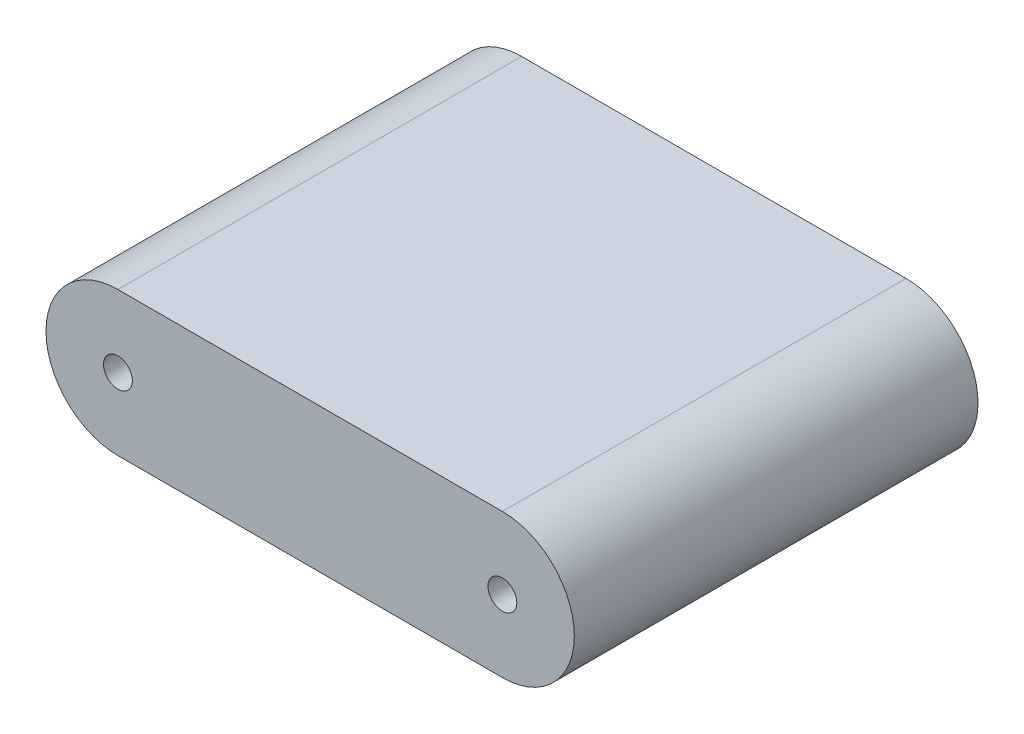
ISO-10303-21;
HEADER;
FILE_DESCRIPTION(('STEP AP214'),'2;1');
FILE_NAME('part.step','',(''),(''),'','','');
FILE_SCHEMA(('AUTOMOTIVE_DESIGN { 1 0 10303 214 1 1 1 1 }'));
ENDSEC;
DATA;
#1=APPLICATION_CONTEXT('core data for automotive mechanical design processes');
#2=APPLICATION_PROTOCOL_DEFINITION('international standard','automotive_design',2000,#1);
#3=PRODUCT_CONTEXT('',#1,'mechanical');
#4=PRODUCT('Part','Part','',(#3));
#5=PRODUCT_RELATED_PRODUCT_CATEGORY('part','',(#4));
#6=PRODUCT_DEFINITION_FORMATION('','',#4);
#7=PRODUCT_DEFINITION_CONTEXT('part definition',#1,'design');
#8=PRODUCT_DEFINITION('design','',#6,#7);
#9=PRODUCT_DEFINITION_SHAPE('','',#8);
#10=(LENGTH_UNIT() NAMED_UNIT(*) SI_UNIT(.MILLI.,.METRE.));
#11=(NAMED_UNIT(*) PLANE_ANGLE_UNIT() SI_UNIT($,.RADIAN.));
#12=(NAMED_UNIT(*) SI_UNIT($,.STERADIAN.) SOLID_ANGLE_UNIT());
#13=UNCERTAINTY_MEASURE_WITH_UNIT(LENGTH_MEASURE(1.E-05),#10,'distance_accuracy_value','');
#14=(GEOMETRIC_REPRESENTATION_CONTEXT(3) GLOBAL_UNCERTAINTY_ASSIGNED_CONTEXT((#13)) GLOBAL_UNIT_ASSIGNED_CONTEXT((#10,
#11,#12)) REPRESENTATION_CONTEXT('',''));
#15=CARTESIAN_POINT('',(0.,0.,0.));
#16=DIRECTION('',(0.,0.,1.));
#17=DIRECTION('',(1.,0.,0.));
#18=AXIS2_PLACEMENT_3D('',#15,#16,#17);
#19=CARTESIAN_POINT('',(-20.,0.,42.));
#20=DIRECTION('',(0.,0.,1.));
#21=DIRECTION('',(1.,0.,0.));
#22=AXIS2_PLACEMENT_3D('',#19,#20,#21);
#23=PLANE('',#22);
#24=CARTESIAN_POINT('',(20.,0.,42.));
#25=DIRECTION('',(0.,0.,1.));
#26=DIRECTION('',(1.,0.,0.));
#27=AXIS2_PLACEMENT_3D('',#24,#25,#26);
#28=CIRCLE('',#27,1.5);
#29=CARTESIAN_POINT('',(21.5,0.,42.));
#30=VERTEX_POINT('',#29);
#31=EDGE_CURVE('E105',#30,#30,#28,.T.);
#32=ORIENTED_EDGE('',*,*,#31,.F.);
#33=EDGE_LOOP('',(#32));
#34=FACE_BOUND('',#33,.T.);
#35=CARTESIAN_POINT('',(-20.,0.,42.));
#36=DIRECTION('',(0.,0.,1.));
#37=DIRECTION('',(1.,0.,0.));
#38=AXIS2_PLACEMENT_3D('',#35,#36,#37);
#39=CIRCLE('',#38,7.4832739323454);
#40=CARTESIAN_POINT('',(-20.,7.4832739323454,42.));
#41=VERTEX_POINT('',#40);
#42=CARTESIAN_POINT('',(-20.,-7.4832739323454,42.));
#43=VERTEX_POINT('',#42);
#44=EDGE_CURVE('E90',#41,#43,#39,.T.);
#45=ORIENTED_EDGE('',*,*,#44,.T.);
#46=DIRECTION('',(1.,0.,0.));
#47=VECTOR('',#46,1.);
#48=CARTESIAN_POINT('',(-20.,-7.4832739323454,42.));
#49=LINE('',#48,#47);
#50=CARTESIAN_POINT('',(20.,-7.4832739323454,42.));
#51=VERTEX_POINT('',#50);
#52=EDGE_CURVE('E85',#43,#51,#49,.T.);
#53=ORIENTED_EDGE('',*,*,#52,.T.);
#54=CARTESIAN_POINT('',(20.,0.,42.));
#55=DIRECTION('',(0.,0.,1.));
#56=DIRECTION('',(1.,0.,0.));
#57=AXIS2_PLACEMENT_3D('',#54,#55,#56);
#58=CIRCLE('',#57,7.4832739323454);
#59=CARTESIAN_POINT('',(20.,7.4832739323454,42.));
#60=VERTEX_POINT('',#59);
#61=EDGE_CURVE('E88',#51,#60,#58,.T.);
#62=ORIENTED_EDGE('',*,*,#61,.T.);
#63=DIRECTION('',(-1.,0.,0.));
#64=VECTOR('',#63,1.);
#65=CARTESIAN_POINT('',(-20.,7.4832739323454,42.));
#66=LINE('',#65,#64);
#67=EDGE_CURVE('E55',#60,#41,#66,.T.);
#68=ORIENTED_EDGE('',*,*,#67,.T.);
#69=EDGE_LOOP('',(#45,#53,#62,#68));
#70=FACE_BOUND('',#69,.T.);
#71=CARTESIAN_POINT('',(-20.,0.,42.));
#72=DIRECTION('',(0.,0.,1.));
#73=DIRECTION('',(1.,0.,0.));
#74=AXIS2_PLACEMENT_3D('',#71,#72,#73);
#75=CIRCLE('',#74,1.5);
#76=CARTESIAN_POINT('',(-18.5,0.,42.));
#77=VERTEX_POINT('',#76);
#78=EDGE_CURVE('E120',#77,#77,#75,.T.);
#79=ORIENTED_EDGE('',*,*,#78,.F.);
#80=EDGE_LOOP('',(#79));
#81=FACE_BOUND('',#80,.T.);
#82=ADVANCED_FACE('F38',(#34,#70,#81),#23,.T.);
#83=CARTESIAN_POINT('',(-20.,0.,0.));
#84=DIRECTION('',(0.,0.,1.));
#85=DIRECTION('',(1.,0.,0.));
#86=AXIS2_PLACEMENT_3D('',#83,#84,#85);
#87=PLANE('',#86);
#88=CARTESIAN_POINT('',(-20.,0.,0.));
#89=DIRECTION('',(0.,0.,1.));
#90=DIRECTION('',(1.,0.,0.));
#91=AXIS2_PLACEMENT_3D('',#88,#89,#90);
#92=CIRCLE('',#91,7.4832739323454);
#93=CARTESIAN_POINT('',(-20.,7.4832739323454,0.));
#94=VERTEX_POINT('',#93);
#95=CARTESIAN_POINT('',(-20.,-7.4832739323454,0.));
#96=VERTEX_POINT('',#95);
#97=EDGE_CURVE('E102',#94,#96,#92,.T.);
#98=ORIENTED_EDGE('',*,*,#97,.F.);
#99=DIRECTION('',(-1.,0.,0.));
#100=VECTOR('',#99,1.);
#101=CARTESIAN_POINT('',(-20.,7.4832739323454,0.));
#102=LINE('',#101,#100);
#103=CARTESIAN_POINT('',(20.,7.4832739323454,0.));
#104=VERTEX_POINT('',#103);
#105=EDGE_CURVE('E78',#104,#94,#102,.T.);
#106=ORIENTED_EDGE('',*,*,#105,.F.);
#107=CARTESIAN_POINT('',(20.,0.,0.));
#108=DIRECTION('',(0.,0.,1.));
#109=DIRECTION('',(1.,0.,0.));
#110=AXIS2_PLACEMENT_3D('',#107,#108,#109);
#111=CIRCLE('',#110,7.4832739323454);
#112=CARTESIAN_POINT('',(20.,-7.4832739323454,0.));
#113=VERTEX_POINT('',#112);
#114=EDGE_CURVE('E72',#113,#104,#111,.T.);
#115=ORIENTED_EDGE('',*,*,#114,.F.);
#116=DIRECTION('',(1.,0.,0.));
#117=VECTOR('',#116,1.);
#118=CARTESIAN_POINT('',(-20.,-7.4832739323454,0.));
#119=LINE('',#118,#117);
#120=EDGE_CURVE('E94',#96,#113,#119,.T.);
#121=ORIENTED_EDGE('',*,*,#120,.F.);
#122=EDGE_LOOP('',(#98,#106,#115,#121));
#123=FACE_BOUND('',#122,.T.);
#124=CARTESIAN_POINT('',(20.,0.,0.));
#125=DIRECTION('',(0.,0.,1.));
#126=DIRECTION('',(1.,0.,0.));
#127=AXIS2_PLACEMENT_3D('',#124,#125,#126);
#128=CIRCLE('',#127,1.5);
#129=CARTESIAN_POINT('',(21.5,0.,0.));
#130=VERTEX_POINT('',#129);
#131=EDGE_CURVE('E117',#130,#130,#128,.T.);
#132=ORIENTED_EDGE('',*,*,#131,.T.);
#133=EDGE_LOOP('',(#132));
#134=FACE_BOUND('',#133,.T.);
#135=CARTESIAN_POINT('',(-20.,0.,0.));
#136=DIRECTION('',(0.,0.,1.));
#137=DIRECTION('',(1.,0.,0.));
#138=AXIS2_PLACEMENT_3D('',#135,#136,#137);
#139=CIRCLE('',#138,1.5);
#140=CARTESIAN_POINT('',(-18.5,0.,0.));
#141=VERTEX_POINT('',#140);
#142=EDGE_CURVE('E123',#141,#141,#139,.T.);
#143=ORIENTED_EDGE('',*,*,#142,.T.);
#144=EDGE_LOOP('',(#143));
#145=FACE_BOUND('',#144,.T.);
#146=ADVANCED_FACE('F113',(#123,#134,#145),#87,.F.);
#147=CARTESIAN_POINT('',(-20.,0.,42.));
#148=DIRECTION('',(0.,0.,-1.));
#149=DIRECTION('',(-1.,0.,0.));
#150=AXIS2_PLACEMENT_3D('',#147,#148,#149);
#151=CYLINDRICAL_SURFACE('',#150,7.4832739323454);
#152=ORIENTED_EDGE('',*,*,#97,.T.);
#153=DIRECTION('',(0.,0.,-1.));
#154=VECTOR('',#153,1.);
#155=CARTESIAN_POINT('',(-20.,-7.4832739323454,42.));
#156=LINE('',#155,#154);
#157=EDGE_CURVE('E11',#43,#96,#156,.T.);
#158=ORIENTED_EDGE('',*,*,#157,.F.);
#159=ORIENTED_EDGE('',*,*,#44,.F.);
#160=DIRECTION('',(0.,0.,-1.));
#161=VECTOR('',#160,1.);
#162=CARTESIAN_POINT('',(-20.,7.4832739323454,42.));
#163=LINE('',#162,#161);
#164=EDGE_CURVE('E98',#41,#94,#163,.T.);
#165=ORIENTED_EDGE('',*,*,#164,.T.);
#166=EDGE_LOOP('',(#152,#158,#159,#165));
#167=FACE_BOUND('',#166,.T.);
#168=ADVANCED_FACE('F40',(#167),#151,.T.);
#169=CARTESIAN_POINT('',(-20.,-7.4832739323454,42.));
#170=DIRECTION('',(0.,1.,0.));
#171=DIRECTION('',(0.,0.,1.));
#172=AXIS2_PLACEMENT_3D('',#169,#170,#171);
#173=PLANE('',#172);
#174=ORIENTED_EDGE('',*,*,#120,.T.);
#175=DIRECTION('',(0.,0.,-1.));
#176=VECTOR('',#175,1.);
#177=CARTESIAN_POINT('',(20.,-7.4832739323454,42.));
#178=LINE('',#177,#176);
#179=EDGE_CURVE('E47',#51,#113,#178,.T.);
#180=ORIENTED_EDGE('',*,*,#179,.F.);
#181=ORIENTED_EDGE('',*,*,#52,.F.);
#182=ORIENTED_EDGE('',*,*,#157,.T.);
#183=EDGE_LOOP('',(#174,#180,#181,#182));
#184=FACE_BOUND('',#183,.T.);
#185=ADVANCED_FACE('F93',(#184),#173,.F.);
#186=CARTESIAN_POINT('',(20.,0.,42.));
#187=DIRECTION('',(0.,0.,-1.));
#188=DIRECTION('',(-1.,0.,0.));
#189=AXIS2_PLACEMENT_3D('',#186,#187,#188);
#190=CYLINDRICAL_SURFACE('',#189,7.4832739323454);
#191=ORIENTED_EDGE('',*,*,#114,.T.);
#192=DIRECTION('',(0.,0.,-1.));
#193=VECTOR('',#192,1.);
#194=CARTESIAN_POINT('',(20.,7.4832739323454,42.));
#195=LINE('',#194,#193);
#196=EDGE_CURVE('E95',#60,#104,#195,.T.);
#197=ORIENTED_EDGE('',*,*,#196,.F.);
#198=ORIENTED_EDGE('',*,*,#61,.F.);
#199=ORIENTED_EDGE('',*,*,#179,.T.);
#200=EDGE_LOOP('',(#191,#197,#198,#199));
#201=FACE_BOUND('',#200,.T.);
#202=ADVANCED_FACE('F96',(#201),#190,.T.);
#203=CARTESIAN_POINT('',(-20.,7.4832739323454,42.));
#204=DIRECTION('',(0.,-1.,0.));
#205=DIRECTION('',(0.,0.,-1.));
#206=AXIS2_PLACEMENT_3D('',#203,#204,#205);
#207=PLANE('',#206);
#208=ORIENTED_EDGE('',*,*,#105,.T.);
#209=ORIENTED_EDGE('',*,*,#164,.F.);
#210=ORIENTED_EDGE('',*,*,#67,.F.);
#211=ORIENTED_EDGE('',*,*,#196,.T.);
#212=EDGE_LOOP('',(#208,#209,#210,#211));
#213=FACE_BOUND('',#212,.T.);
#214=ADVANCED_FACE('F110',(#213),#207,.F.);
#215=CARTESIAN_POINT('',(20.,0.,42.));
#216=DIRECTION('',(0.,0.,-1.));
#217=DIRECTION('',(-1.,0.,0.));
#218=AXIS2_PLACEMENT_3D('',#215,#216,#217);
#219=CYLINDRICAL_SURFACE('',#218,1.5);
#220=ORIENTED_EDGE('',*,*,#31,.T.);
#221=EDGE_LOOP('',(#220));
#222=FACE_BOUND('',#221,.T.);
#223=ORIENTED_EDGE('',*,*,#131,.F.);
#224=EDGE_LOOP('',(#223));
#225=FACE_BOUND('',#224,.T.);
#226=ADVANCED_FACE('F140',(#222,#225),#219,.F.);
#227=CARTESIAN_POINT('',(-20.,0.,42.));
#228=DIRECTION('',(0.,0.,-1.));
#229=DIRECTION('',(-1.,0.,0.));
#230=AXIS2_PLACEMENT_3D('',#227,#228,#229);
#231=CYLINDRICAL_SURFACE('',#230,1.5);
#232=ORIENTED_EDGE('',*,*,#78,.T.);
#233=EDGE_LOOP('',(#232));
#234=FACE_BOUND('',#233,.T.);
#235=ORIENTED_EDGE('',*,*,#142,.F.);
#236=EDGE_LOOP('',(#235));
#237=FACE_BOUND('',#236,.T.);
#238=ADVANCED_FACE('F129',(#234,#237),#231,.F.);
#239=CLOSED_SHELL('',(#82,#146,#168,#185,#202,#214,#226,#238));
#240=MANIFOLD_SOLID_BREP('B2',#239);
#241=ADVANCED_BREP_SHAPE_REPRESENTATION('',(#18,#240),#14);
#242=SHAPE_DEFINITION_REPRESENTATION(#9,#241);
ENDSEC;
END-ISO-10303-21;
